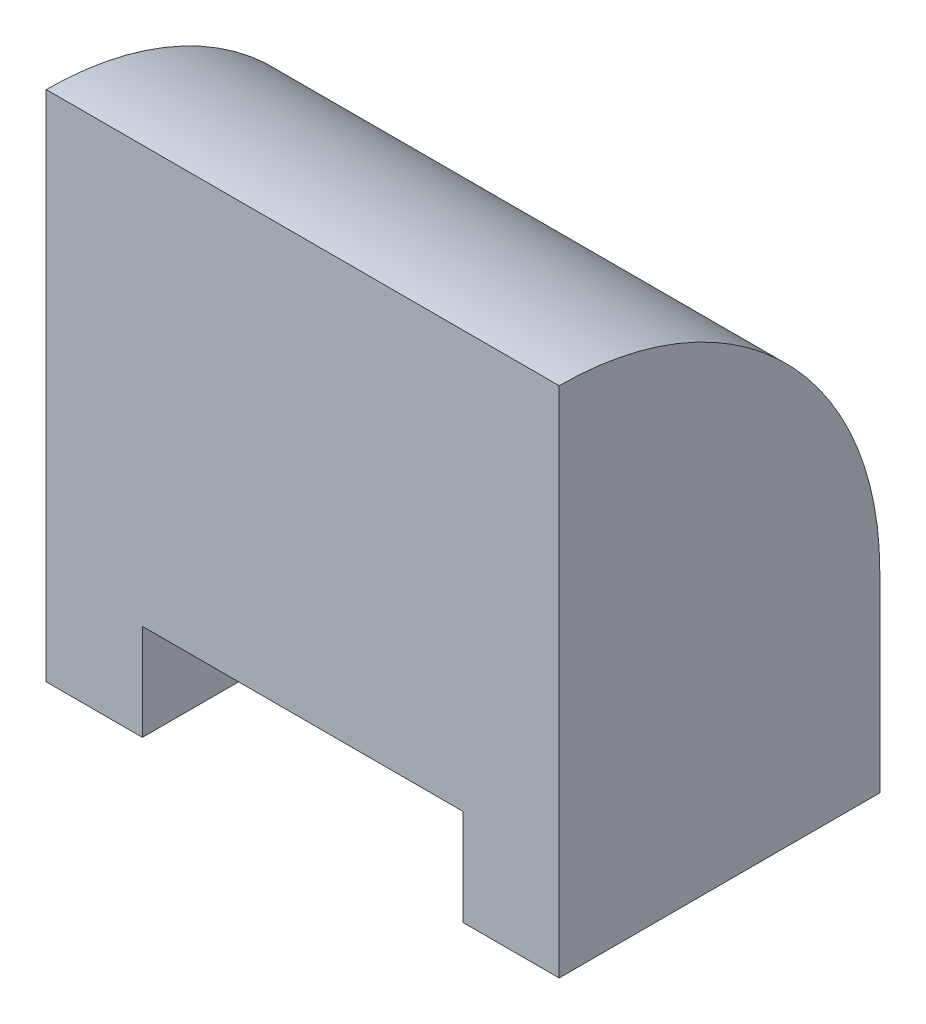
ISO-10303-21;
HEADER;
FILE_DESCRIPTION(('STEP AP214'),'2;1');
FILE_NAME('part.step','',(''),(''),'','','');
FILE_SCHEMA(('AUTOMOTIVE_DESIGN { 1 0 10303 214 1 1 1 1 }'));
ENDSEC;
DATA;
#1=APPLICATION_CONTEXT('core data for automotive mechanical design processes');
#2=APPLICATION_PROTOCOL_DEFINITION('international standard','automotive_design',2000,#1);
#3=PRODUCT_CONTEXT('',#1,'mechanical');
#4=PRODUCT('Part','Part','',(#3));
#5=PRODUCT_RELATED_PRODUCT_CATEGORY('part','',(#4));
#6=PRODUCT_DEFINITION_FORMATION('','',#4);
#7=PRODUCT_DEFINITION_CONTEXT('part definition',#1,'design');
#8=PRODUCT_DEFINITION('design','',#6,#7);
#9=PRODUCT_DEFINITION_SHAPE('','',#8);
#10=(LENGTH_UNIT() NAMED_UNIT(*) SI_UNIT(.MILLI.,.METRE.));
#11=(NAMED_UNIT(*) PLANE_ANGLE_UNIT() SI_UNIT($,.RADIAN.));
#12=(NAMED_UNIT(*) SI_UNIT($,.STERADIAN.) SOLID_ANGLE_UNIT());
#13=UNCERTAINTY_MEASURE_WITH_UNIT(LENGTH_MEASURE(1.E-05),#10,'distance_accuracy_value','');
#14=(GEOMETRIC_REPRESENTATION_CONTEXT(3) GLOBAL_UNCERTAINTY_ASSIGNED_CONTEXT((#13)) GLOBAL_UNIT_ASSIGNED_CONTEXT((#10,
#11,#12)) REPRESENTATION_CONTEXT('',''));
#15=CARTESIAN_POINT('',(0.,0.,0.));
#16=DIRECTION('',(0.,0.,1.));
#17=DIRECTION('',(1.,0.,0.));
#18=AXIS2_PLACEMENT_3D('',#15,#16,#17);
#19=CARTESIAN_POINT('',(80.,0.,0.));
#20=DIRECTION('',(0.,1.,0.));
#21=DIRECTION('',(0.,0.,1.));
#22=AXIS2_PLACEMENT_3D('',#19,#20,#21);
#23=PLANE('',#22);
#24=DIRECTION('',(-1.,0.,0.));
#25=VECTOR('',#24,1.);
#26=CARTESIAN_POINT('',(80.,0.,-50.));
#27=LINE('',#26,#25);
#28=CARTESIAN_POINT('',(15.,0.,-50.));
#29=VERTEX_POINT('',#28);
#30=CARTESIAN_POINT('',(0.,0.,-50.));
#31=VERTEX_POINT('',#30);
#32=EDGE_CURVE('E133',#29,#31,#27,.T.);
#33=ORIENTED_EDGE('',*,*,#32,.F.);
#34=DIRECTION('',(0.,0.,1.));
#35=VECTOR('',#34,1.);
#36=CARTESIAN_POINT('',(15.,0.,-50.));
#37=LINE('',#36,#35);
#38=CARTESIAN_POINT('',(15.,0.,0.));
#39=VERTEX_POINT('',#38);
#40=EDGE_CURVE('E164',#29,#39,#37,.T.);
#41=ORIENTED_EDGE('',*,*,#40,.T.);
#42=DIRECTION('',(-1.,0.,0.));
#43=VECTOR('',#42,1.);
#44=CARTESIAN_POINT('',(80.,0.,0.));
#45=LINE('',#44,#43);
#46=CARTESIAN_POINT('',(0.,0.,0.));
#47=VERTEX_POINT('',#46);
#48=EDGE_CURVE('E132',#39,#47,#45,.T.);
#49=ORIENTED_EDGE('',*,*,#48,.T.);
#50=DIRECTION('',(0.,0.,-1.));
#51=VECTOR('',#50,1.);
#52=CARTESIAN_POINT('',(0.,0.,0.));
#53=LINE('',#52,#51);
#54=EDGE_CURVE('E162',#47,#31,#53,.T.);
#55=ORIENTED_EDGE('',*,*,#54,.T.);
#56=EDGE_LOOP('',(#33,#41,#49,#55));
#57=FACE_BOUND('',#56,.T.);
#58=ADVANCED_FACE('F39',(#57),#23,.F.);
#59=CARTESIAN_POINT('',(80.,80.,0.));
#60=DIRECTION('',(0.,0.,-1.));
#61=DIRECTION('',(0.,1.,0.));
#62=AXIS2_PLACEMENT_3D('',#59,#60,#61);
#63=PLANE('',#62);
#64=ORIENTED_EDGE('',*,*,#48,.F.);
#65=DIRECTION('',(0.,-1.,0.));
#66=VECTOR('',#65,1.);
#67=CARTESIAN_POINT('',(15.,0.,0.));
#68=LINE('',#67,#66);
#69=CARTESIAN_POINT('',(15.,15.,0.));
#70=VERTEX_POINT('',#69);
#71=EDGE_CURVE('E116',#70,#39,#68,.T.);
#72=ORIENTED_EDGE('',*,*,#71,.F.);
#73=DIRECTION('',(-1.,0.,0.));
#74=VECTOR('',#73,1.);
#75=CARTESIAN_POINT('',(15.,15.,0.));
#76=LINE('',#75,#74);
#77=CARTESIAN_POINT('',(65.,15.,0.));
#78=VERTEX_POINT('',#77);
#79=EDGE_CURVE('E185',#78,#70,#76,.T.);
#80=ORIENTED_EDGE('',*,*,#79,.F.);
#81=DIRECTION('',(0.,1.,0.));
#82=VECTOR('',#81,1.);
#83=CARTESIAN_POINT('',(65.,15.,0.));
#84=LINE('',#83,#82);
#85=CARTESIAN_POINT('',(65.,0.,0.));
#86=VERTEX_POINT('',#85);
#87=EDGE_CURVE('E189',#86,#78,#84,.T.);
#88=ORIENTED_EDGE('',*,*,#87,.F.);
#89=CARTESIAN_POINT('',(80.,0.,0.));
#90=VERTEX_POINT('',#89);
#91=EDGE_CURVE('E125',#90,#86,#45,.T.);
#92=ORIENTED_EDGE('',*,*,#91,.F.);
#93=DIRECTION('',(0.,-1.,0.));
#94=VECTOR('',#93,1.);
#95=CARTESIAN_POINT('',(80.,80.,0.));
#96=LINE('',#95,#94);
#97=CARTESIAN_POINT('',(80.,80.,0.));
#98=VERTEX_POINT('',#97);
#99=EDGE_CURVE('E157',#98,#90,#96,.T.);
#100=ORIENTED_EDGE('',*,*,#99,.F.);
#101=DIRECTION('',(-1.,0.,0.));
#102=VECTOR('',#101,1.);
#103=CARTESIAN_POINT('',(80.,80.,0.));
#104=LINE('',#103,#102);
#105=CARTESIAN_POINT('',(0.,80.,0.));
#106=VERTEX_POINT('',#105);
#107=EDGE_CURVE('E143',#98,#106,#104,.T.);
#108=ORIENTED_EDGE('',*,*,#107,.T.);
#109=DIRECTION('',(0.,-1.,0.));
#110=VECTOR('',#109,1.);
#111=CARTESIAN_POINT('',(0.,80.,0.));
#112=LINE('',#111,#110);
#113=EDGE_CURVE('E155',#106,#47,#112,.T.);
#114=ORIENTED_EDGE('',*,*,#113,.T.);
#115=EDGE_LOOP('',(#64,#72,#80,#88,#92,#100,#108,#114));
#116=FACE_BOUND('',#115,.T.);
#117=ADVANCED_FACE('F154',(#116),#63,.F.);
#118=ORIENTED_EDGE('',*,*,#91,.T.);
#119=DIRECTION('',(0.,0.,1.));
#120=VECTOR('',#119,1.);
#121=CARTESIAN_POINT('',(65.,0.,-50.));
#122=LINE('',#121,#120);
#123=CARTESIAN_POINT('',(65.,0.,-50.));
#124=VERTEX_POINT('',#123);
#125=EDGE_CURVE('E109',#124,#86,#122,.T.);
#126=ORIENTED_EDGE('',*,*,#125,.F.);
#127=CARTESIAN_POINT('',(80.,0.,-50.));
#128=VERTEX_POINT('',#127);
#129=EDGE_CURVE('E123',#128,#124,#27,.T.);
#130=ORIENTED_EDGE('',*,*,#129,.F.);
#131=DIRECTION('',(0.,0.,-1.));
#132=VECTOR('',#131,1.);
#133=CARTESIAN_POINT('',(80.,0.,0.));
#134=LINE('',#133,#132);
#135=EDGE_CURVE('E174',#90,#128,#134,.T.);
#136=ORIENTED_EDGE('',*,*,#135,.F.);
#137=EDGE_LOOP('',(#118,#126,#130,#136));
#138=FACE_BOUND('',#137,.T.);
#139=ADVANCED_FACE('F121',(#138),#23,.F.);
#140=CARTESIAN_POINT('',(80.,0.,-50.));
#141=DIRECTION('',(0.,0.,1.));
#142=DIRECTION('',(1.,0.,0.));
#143=AXIS2_PLACEMENT_3D('',#140,#141,#142);
#144=PLANE('',#143);
#145=DIRECTION('',(0.,1.,0.));
#146=VECTOR('',#145,1.);
#147=CARTESIAN_POINT('',(0.,0.,-50.));
#148=LINE('',#147,#146);
#149=CARTESIAN_POINT('',(0.,30.,-50.));
#150=VERTEX_POINT('',#149);
#151=EDGE_CURVE('E139',#31,#150,#148,.T.);
#152=ORIENTED_EDGE('',*,*,#151,.T.);
#153=DIRECTION('',(-1.,0.,0.));
#154=VECTOR('',#153,1.);
#155=CARTESIAN_POINT('',(80.,30.,-50.));
#156=LINE('',#155,#154);
#157=CARTESIAN_POINT('',(80.,30.,-50.));
#158=VERTEX_POINT('',#157);
#159=EDGE_CURVE('E48',#150,#158,#156,.F.);
#160=ORIENTED_EDGE('',*,*,#159,.T.);
#161=DIRECTION('',(0.,1.,0.));
#162=VECTOR('',#161,1.);
#163=CARTESIAN_POINT('',(80.,0.,-50.));
#164=LINE('',#163,#162);
#165=EDGE_CURVE('E130',#128,#158,#164,.T.);
#166=ORIENTED_EDGE('',*,*,#165,.F.);
#167=ORIENTED_EDGE('',*,*,#129,.T.);
#168=DIRECTION('',(0.,1.,0.));
#169=VECTOR('',#168,1.);
#170=CARTESIAN_POINT('',(65.,15.,-50.));
#171=LINE('',#170,#169);
#172=CARTESIAN_POINT('',(65.,15.,-50.));
#173=VERTEX_POINT('',#172);
#174=EDGE_CURVE('E105',#124,#173,#171,.T.);
#175=ORIENTED_EDGE('',*,*,#174,.T.);
#176=DIRECTION('',(-1.,0.,0.));
#177=VECTOR('',#176,1.);
#178=CARTESIAN_POINT('',(15.,15.,-50.));
#179=LINE('',#178,#177);
#180=CARTESIAN_POINT('',(15.,15.,-50.));
#181=VERTEX_POINT('',#180);
#182=EDGE_CURVE('E115',#173,#181,#179,.T.);
#183=ORIENTED_EDGE('',*,*,#182,.T.);
#184=DIRECTION('',(0.,-1.,0.));
#185=VECTOR('',#184,1.);
#186=CARTESIAN_POINT('',(15.,0.,-50.));
#187=LINE('',#186,#185);
#188=EDGE_CURVE('E127',#181,#29,#187,.T.);
#189=ORIENTED_EDGE('',*,*,#188,.T.);
#190=ORIENTED_EDGE('',*,*,#32,.T.);
#191=EDGE_LOOP('',(#152,#160,#166,#167,#175,#183,#189,#190));
#192=FACE_BOUND('',#191,.T.);
#193=ADVANCED_FACE('F129',(#192),#144,.F.);
#194=CARTESIAN_POINT('',(80.,0.,0.));
#195=DIRECTION('',(1.,0.,0.));
#196=DIRECTION('',(0.,0.,-1.));
#197=AXIS2_PLACEMENT_3D('',#194,#195,#196);
#198=PLANE('',#197);
#199=ORIENTED_EDGE('',*,*,#165,.T.);
#200=CARTESIAN_POINT('',(80.,30.,0.));
#201=DIRECTION('',(1.,0.,0.));
#202=DIRECTION('',(0.,0.,-1.));
#203=AXIS2_PLACEMENT_3D('',#200,#201,#202);
#204=CIRCLE('',#203,50.);
#205=EDGE_CURVE('E11',#158,#98,#204,.T.);
#206=ORIENTED_EDGE('',*,*,#205,.T.);
#207=ORIENTED_EDGE('',*,*,#99,.T.);
#208=ORIENTED_EDGE('',*,*,#135,.T.);
#209=EDGE_LOOP('',(#199,#206,#207,#208));
#210=FACE_BOUND('',#209,.T.);
#211=ADVANCED_FACE('F236',(#210),#198,.T.);
#212=CARTESIAN_POINT('',(0.,0.,0.));
#213=DIRECTION('',(1.,0.,0.));
#214=DIRECTION('',(0.,0.,-1.));
#215=AXIS2_PLACEMENT_3D('',#212,#213,#214);
#216=PLANE('',#215);
#217=ORIENTED_EDGE('',*,*,#113,.F.);
#218=CARTESIAN_POINT('',(0.,30.,0.));
#219=DIRECTION('',(1.,0.,0.));
#220=DIRECTION('',(0.,0.,-1.));
#221=AXIS2_PLACEMENT_3D('',#218,#219,#220);
#222=CIRCLE('',#221,50.);
#223=EDGE_CURVE('E62',#106,#150,#222,.F.);
#224=ORIENTED_EDGE('',*,*,#223,.T.);
#225=ORIENTED_EDGE('',*,*,#151,.F.);
#226=ORIENTED_EDGE('',*,*,#54,.F.);
#227=EDGE_LOOP('',(#217,#224,#225,#226));
#228=FACE_BOUND('',#227,.T.);
#229=ADVANCED_FACE('F160',(#228),#216,.F.);
#230=CARTESIAN_POINT('',(15.,0.,-50.));
#231=DIRECTION('',(-1.,0.,0.));
#232=DIRECTION('',(0.,0.,1.));
#233=AXIS2_PLACEMENT_3D('',#230,#231,#232);
#234=PLANE('',#233);
#235=ORIENTED_EDGE('',*,*,#71,.T.);
#236=ORIENTED_EDGE('',*,*,#40,.F.);
#237=ORIENTED_EDGE('',*,*,#188,.F.);
#238=DIRECTION('',(0.,0.,1.));
#239=VECTOR('',#238,1.);
#240=CARTESIAN_POINT('',(15.,15.,-50.));
#241=LINE('',#240,#239);
#242=EDGE_CURVE('E169',#181,#70,#241,.T.);
#243=ORIENTED_EDGE('',*,*,#242,.T.);
#244=EDGE_LOOP('',(#235,#236,#237,#243));
#245=FACE_BOUND('',#244,.T.);
#246=ADVANCED_FACE('F217',(#245),#234,.F.);
#247=CARTESIAN_POINT('',(15.,15.,-50.));
#248=DIRECTION('',(0.,1.,0.));
#249=DIRECTION('',(0.,0.,1.));
#250=AXIS2_PLACEMENT_3D('',#247,#248,#249);
#251=PLANE('',#250);
#252=CARTESIAN_POINT('',(40.,15.,-25.));
#253=DIRECTION('',(0.,-1.,0.));
#254=DIRECTION('',(0.,0.,-1.));
#255=AXIS2_PLACEMENT_3D('',#252,#253,#254);
#256=CIRCLE('',#255,5.);
#257=CARTESIAN_POINT('',(40.,15.,-30.));
#258=VERTEX_POINT('',#257);
#259=EDGE_CURVE('E198',#258,#258,#256,.T.);
#260=ORIENTED_EDGE('',*,*,#259,.F.);
#261=EDGE_LOOP('',(#260));
#262=FACE_BOUND('',#261,.T.);
#263=ORIENTED_EDGE('',*,*,#79,.T.);
#264=ORIENTED_EDGE('',*,*,#242,.F.);
#265=ORIENTED_EDGE('',*,*,#182,.F.);
#266=DIRECTION('',(0.,0.,1.));
#267=VECTOR('',#266,1.);
#268=CARTESIAN_POINT('',(65.,15.,-50.));
#269=LINE('',#268,#267);
#270=EDGE_CURVE('E111',#173,#78,#269,.T.);
#271=ORIENTED_EDGE('',*,*,#270,.T.);
#272=EDGE_LOOP('',(#263,#264,#265,#271));
#273=FACE_BOUND('',#272,.T.);
#274=ADVANCED_FACE('F214',(#262,#273),#251,.F.);
#275=CARTESIAN_POINT('',(65.,15.,-50.));
#276=DIRECTION('',(1.,0.,0.));
#277=DIRECTION('',(0.,0.,-1.));
#278=AXIS2_PLACEMENT_3D('',#275,#276,#277);
#279=PLANE('',#278);
#280=ORIENTED_EDGE('',*,*,#87,.T.);
#281=ORIENTED_EDGE('',*,*,#270,.F.);
#282=ORIENTED_EDGE('',*,*,#174,.F.);
#283=ORIENTED_EDGE('',*,*,#125,.T.);
#284=EDGE_LOOP('',(#280,#281,#282,#283));
#285=FACE_BOUND('',#284,.T.);
#286=ADVANCED_FACE('F108',(#285),#279,.F.);
#287=CARTESIAN_POINT('',(80.,30.,0.));
#288=DIRECTION('',(-1.,0.,0.));
#289=DIRECTION('',(0.,0.,1.));
#290=AXIS2_PLACEMENT_3D('',#287,#288,#289);
#291=CYLINDRICAL_SURFACE('',#290,50.);
#292=ORIENTED_EDGE('',*,*,#205,.F.);
#293=ORIENTED_EDGE('',*,*,#159,.F.);
#294=ORIENTED_EDGE('',*,*,#223,.F.);
#295=ORIENTED_EDGE('',*,*,#107,.F.);
#296=EDGE_LOOP('',(#292,#293,#294,#295));
#297=FACE_BOUND('',#296,.T.);
#298=ADVANCED_FACE('F41',(#297),#291,.T.);
#299=CARTESIAN_POINT('',(40.,40.,-25.));
#300=DIRECTION('',(0.,-1.,0.));
#301=DIRECTION('',(0.,0.,-1.));
#302=AXIS2_PLACEMENT_3D('',#299,#300,#301);
#303=CYLINDRICAL_SURFACE('',#302,5.);
#304=CARTESIAN_POINT('',(40.,40.,-25.));
#305=DIRECTION('',(0.,-1.,0.));
#306=DIRECTION('',(0.,0.,-1.));
#307=AXIS2_PLACEMENT_3D('',#304,#305,#306);
#308=CIRCLE('',#307,5.);
#309=CARTESIAN_POINT('',(40.,40.,-30.));
#310=VERTEX_POINT('',#309);
#311=EDGE_CURVE('E192',#310,#310,#308,.T.);
#312=ORIENTED_EDGE('',*,*,#311,.F.);
#313=EDGE_LOOP('',(#312));
#314=FACE_BOUND('',#313,.T.);
#315=ORIENTED_EDGE('',*,*,#259,.T.);
#316=EDGE_LOOP('',(#315));
#317=FACE_BOUND('',#316,.T.);
#318=ADVANCED_FACE('F208',(#314,#317),#303,.F.);
#319=CARTESIAN_POINT('',(40.,40.,-25.));
#320=DIRECTION('',(0.,-1.,0.));
#321=DIRECTION('',(0.,0.,-1.));
#322=AXIS2_PLACEMENT_3D('',#319,#320,#321);
#323=PLANE('',#322);
#324=ORIENTED_EDGE('',*,*,#311,.T.);
#325=EDGE_LOOP('',(#324));
#326=FACE_BOUND('',#325,.T.);
#327=ADVANCED_FACE('F206',(#326),#323,.T.);
#328=CLOSED_SHELL('',(#58,#117,#139,#193,#211,#229,#246,#274,#286,#298,#318,#327));
#329=MANIFOLD_SOLID_BREP('B2',#328);
#330=ADVANCED_BREP_SHAPE_REPRESENTATION('',(#18,#329),#14);
#331=SHAPE_DEFINITION_REPRESENTATION(#9,#330);
ENDSEC;
END-ISO-10303-21;
